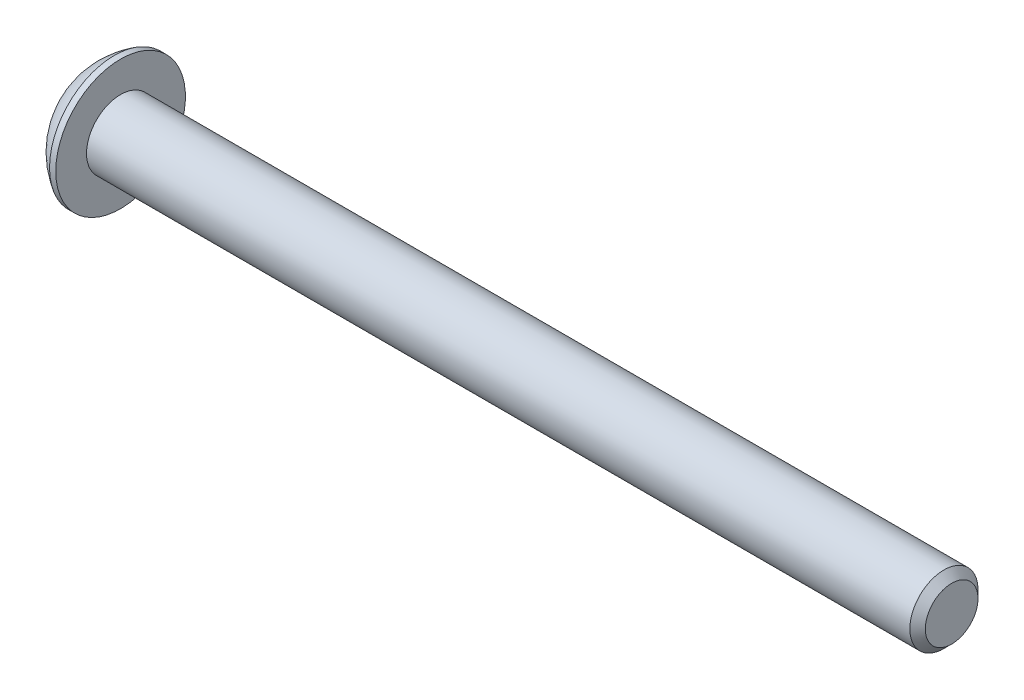
ISO-10303-21;
HEADER;
FILE_DESCRIPTION(('STEP AP214'),'2;1');
FILE_NAME('part.step','',(''),(''),'','','');
FILE_SCHEMA(('AUTOMOTIVE_DESIGN { 1 0 10303 214 1 1 1 1 }'));
ENDSEC;
DATA;
#1=APPLICATION_CONTEXT('core data for automotive mechanical design processes');
#2=APPLICATION_PROTOCOL_DEFINITION('international standard','automotive_design',2000,#1);
#3=PRODUCT_CONTEXT('',#1,'mechanical');
#4=PRODUCT('Part','Part','',(#3));
#5=PRODUCT_RELATED_PRODUCT_CATEGORY('part','',(#4));
#6=PRODUCT_DEFINITION_FORMATION('','',#4);
#7=PRODUCT_DEFINITION_CONTEXT('part definition',#1,'design');
#8=PRODUCT_DEFINITION('design','',#6,#7);
#9=PRODUCT_DEFINITION_SHAPE('','',#8);
#10=(LENGTH_UNIT() NAMED_UNIT(*) SI_UNIT(.MILLI.,.METRE.));
#11=(NAMED_UNIT(*) PLANE_ANGLE_UNIT() SI_UNIT($,.RADIAN.));
#12=(NAMED_UNIT(*) SI_UNIT($,.STERADIAN.) SOLID_ANGLE_UNIT());
#13=UNCERTAINTY_MEASURE_WITH_UNIT(LENGTH_MEASURE(1.E-05),#10,'distance_accuracy_value','');
#14=(GEOMETRIC_REPRESENTATION_CONTEXT(3) GLOBAL_UNCERTAINTY_ASSIGNED_CONTEXT((#13)) GLOBAL_UNIT_ASSIGNED_CONTEXT((#10,
#11,#12)) REPRESENTATION_CONTEXT('',''));
#15=CARTESIAN_POINT('',(0.,0.,0.));
#16=DIRECTION('',(0.,0.,1.));
#17=DIRECTION('',(1.,0.,0.));
#18=AXIS2_PLACEMENT_3D('',#15,#16,#17);
#19=CARTESIAN_POINT('',(1.32080000000034,0.,0.));
#20=DIRECTION('',(-1.,0.,0.));
#21=DIRECTION('',(0.,0.,1.));
#22=AXIS2_PLACEMENT_3D('',#19,#20,#21);
#23=CONICAL_SURFACE('',#22,1.1937999999998,1.04719755119608);
#24=CARTESIAN_POINT('',(2.01004075135902,0.,4.44089209850063E-13));
#25=VERTEX_POINT('',#24);
#26=VERTEX_LOOP('',#25);
#27=FACE_BOUND('',#26,.T.);
#28=CARTESIAN_POINT('',(1.32080000000009,0.,0.));
#29=DIRECTION('',(-1.,0.,0.));
#30=DIRECTION('',(0.,0.,1.));
#31=AXIS2_PLACEMENT_3D('',#28,#29,#30);
#32=CIRCLE('',#31,1.19380000000024);
#33=CARTESIAN_POINT('',(1.32080000000004,-1.03386112703797,0.59690000000006));
#34=VERTEX_POINT('',#33);
#35=CARTESIAN_POINT('',(1.32080000000004,0.,1.19380000000012));
#36=VERTEX_POINT('',#35);
#37=EDGE_CURVE('E19',#34,#36,#32,.T.);
#38=ORIENTED_EDGE('',*,*,#37,.T.);
#39=CARTESIAN_POINT('',(1.32080000000009,0.,0.));
#40=DIRECTION('',(-1.,0.,0.));
#41=DIRECTION('',(0.,0.,1.));
#42=AXIS2_PLACEMENT_3D('',#39,#40,#41);
#43=CIRCLE('',#42,1.19380000000024);
#44=CARTESIAN_POINT('',(1.32080000000004,1.03386112703797,0.596900000000061));
#45=VERTEX_POINT('',#44);
#46=EDGE_CURVE('E147',#36,#45,#43,.T.);
#47=ORIENTED_EDGE('',*,*,#46,.T.);
#48=CARTESIAN_POINT('',(1.32080000000009,0.,0.));
#49=DIRECTION('',(-1.,0.,0.));
#50=DIRECTION('',(0.,0.,1.));
#51=AXIS2_PLACEMENT_3D('',#48,#49,#50);
#52=CIRCLE('',#51,1.19380000000024);
#53=CARTESIAN_POINT('',(1.32080000000004,1.03386112703797,-0.596900000000061));
#54=VERTEX_POINT('',#53);
#55=EDGE_CURVE('E317',#45,#54,#52,.T.);
#56=ORIENTED_EDGE('',*,*,#55,.T.);
#57=CARTESIAN_POINT('',(1.32080000000009,0.,0.));
#58=DIRECTION('',(-1.,0.,0.));
#59=DIRECTION('',(0.,0.,1.));
#60=AXIS2_PLACEMENT_3D('',#57,#58,#59);
#61=CIRCLE('',#60,1.19380000000024);
#62=CARTESIAN_POINT('',(1.32080000000004,1.49457637585666E-12,-1.19380000000012));
#63=VERTEX_POINT('',#62);
#64=EDGE_CURVE('E318',#54,#63,#61,.T.);
#65=ORIENTED_EDGE('',*,*,#64,.T.);
#66=CARTESIAN_POINT('',(1.32080000000009,0.,0.));
#67=DIRECTION('',(-1.,0.,0.));
#68=DIRECTION('',(0.,0.,1.));
#69=AXIS2_PLACEMENT_3D('',#66,#67,#68);
#70=CIRCLE('',#69,1.19380000000024);
#71=CARTESIAN_POINT('',(1.32080000000004,-1.03386112703797,-0.59690000000006));
#72=VERTEX_POINT('',#71);
#73=EDGE_CURVE('E92',#63,#72,#70,.T.);
#74=ORIENTED_EDGE('',*,*,#73,.T.);
#75=CARTESIAN_POINT('',(1.32080000000009,0.,0.));
#76=DIRECTION('',(-1.,0.,0.));
#77=DIRECTION('',(0.,0.,1.));
#78=AXIS2_PLACEMENT_3D('',#75,#76,#77);
#79=CIRCLE('',#78,1.19380000000024);
#80=EDGE_CURVE('E88',#72,#34,#79,.T.);
#81=ORIENTED_EDGE('',*,*,#80,.T.);
#82=EDGE_LOOP('',(#38,#47,#56,#65,#74,#81));
#83=FACE_BOUND('',#82,.T.);
#84=ADVANCED_FACE('F16',(#27,#83),#23,.F.);
#85=CARTESIAN_POINT('',(1.3208,-2.06772225407572,-1.1938));
#86=DIRECTION('',(1.,0.,0.));
#87=DIRECTION('',(0.,0.,-1.));
#88=AXIS2_PLACEMENT_3D('',#85,#86,#87);
#89=PLANE('',#88);
#90=DIRECTION('',(0.,0.5,0.866025403784439));
#91=VECTOR('',#90,1.);
#92=CARTESIAN_POINT('',(1.3208,-1.37848150271715,0.));
#93=LINE('',#92,#91);
#94=CARTESIAN_POINT('',(1.3208,-0.689240751358574,1.1938));
#95=VERTEX_POINT('',#94);
#96=EDGE_CURVE('E100',#95,#34,#93,.F.);
#97=ORIENTED_EDGE('',*,*,#96,.F.);
#98=DIRECTION('',(0.,1.,0.));
#99=VECTOR('',#98,1.);
#100=CARTESIAN_POINT('',(1.3208,-0.689240751358574,1.1938));
#101=LINE('',#100,#99);
#102=EDGE_CURVE('E102',#36,#95,#101,.F.);
#103=ORIENTED_EDGE('',*,*,#102,.F.);
#104=ORIENTED_EDGE('',*,*,#37,.F.);
#105=EDGE_LOOP('',(#97,#103,#104));
#106=FACE_BOUND('',#105,.T.);
#107=ADVANCED_FACE('F98',(#106),#89,.F.);
#108=CARTESIAN_POINT('',(1.3208,-2.06772225407572,-1.1938));
#109=DIRECTION('',(1.,0.,0.));
#110=DIRECTION('',(0.,0.,-1.));
#111=AXIS2_PLACEMENT_3D('',#108,#109,#110);
#112=PLANE('',#111);
#113=DIRECTION('',(0.,-0.5,0.866025403784439));
#114=VECTOR('',#113,1.);
#115=CARTESIAN_POINT('',(1.3208,-0.689240751358574,-1.1938));
#116=LINE('',#115,#114);
#117=CARTESIAN_POINT('',(1.3208,-1.37848150271715,0.));
#118=VERTEX_POINT('',#117);
#119=EDGE_CURVE('E108',#118,#72,#116,.F.);
#120=ORIENTED_EDGE('',*,*,#119,.F.);
#121=DIRECTION('',(0.,0.5,0.866025403784439));
#122=VECTOR('',#121,1.);
#123=CARTESIAN_POINT('',(1.3208,-1.37848150271715,0.));
#124=LINE('',#123,#122);
#125=EDGE_CURVE('E105',#34,#118,#124,.F.);
#126=ORIENTED_EDGE('',*,*,#125,.F.);
#127=ORIENTED_EDGE('',*,*,#80,.F.);
#128=EDGE_LOOP('',(#120,#126,#127));
#129=FACE_BOUND('',#128,.T.);
#130=ADVANCED_FACE('F106',(#129),#112,.F.);
#131=CARTESIAN_POINT('',(1.3208,-2.06772225407572,-1.1938));
#132=DIRECTION('',(1.,0.,0.));
#133=DIRECTION('',(0.,0.,-1.));
#134=AXIS2_PLACEMENT_3D('',#131,#132,#133);
#135=PLANE('',#134);
#136=DIRECTION('',(0.,1.,0.));
#137=VECTOR('',#136,1.);
#138=CARTESIAN_POINT('',(1.3208,0.689240751358577,-1.1938));
#139=LINE('',#138,#137);
#140=CARTESIAN_POINT('',(1.3208,-0.689240751358574,-1.1938));
#141=VERTEX_POINT('',#140);
#142=EDGE_CURVE('E287',#141,#63,#139,.T.);
#143=ORIENTED_EDGE('',*,*,#142,.F.);
#144=DIRECTION('',(0.,-0.5,0.866025403784439));
#145=VECTOR('',#144,1.);
#146=CARTESIAN_POINT('',(1.3208,-0.689240751358574,-1.1938));
#147=LINE('',#146,#145);
#148=EDGE_CURVE('E299',#72,#141,#147,.F.);
#149=ORIENTED_EDGE('',*,*,#148,.F.);
#150=ORIENTED_EDGE('',*,*,#73,.F.);
#151=EDGE_LOOP('',(#143,#149,#150));
#152=FACE_BOUND('',#151,.T.);
#153=ADVANCED_FACE('F190',(#152),#135,.F.);
#154=CARTESIAN_POINT('',(1.3208,-2.06772225407572,-1.1938));
#155=DIRECTION('',(1.,0.,0.));
#156=DIRECTION('',(0.,0.,-1.));
#157=AXIS2_PLACEMENT_3D('',#154,#155,#156);
#158=PLANE('',#157);
#159=DIRECTION('',(0.,-0.5,-0.866025403784439));
#160=VECTOR('',#159,1.);
#161=CARTESIAN_POINT('',(1.3208,1.37848150271715,0.));
#162=LINE('',#161,#160);
#163=CARTESIAN_POINT('',(1.3208,0.689240751358577,-1.1938));
#164=VERTEX_POINT('',#163);
#165=EDGE_CURVE('E273',#164,#54,#162,.F.);
#166=ORIENTED_EDGE('',*,*,#165,.F.);
#167=DIRECTION('',(0.,1.,0.));
#168=VECTOR('',#167,1.);
#169=CARTESIAN_POINT('',(1.3208,0.689240751358577,-1.1938));
#170=LINE('',#169,#168);
#171=EDGE_CURVE('E284',#63,#164,#170,.T.);
#172=ORIENTED_EDGE('',*,*,#171,.F.);
#173=ORIENTED_EDGE('',*,*,#64,.F.);
#174=EDGE_LOOP('',(#166,#172,#173));
#175=FACE_BOUND('',#174,.T.);
#176=ADVANCED_FACE('F186',(#175),#158,.F.);
#177=CARTESIAN_POINT('',(1.3208,-2.06772225407572,-1.1938));
#178=DIRECTION('',(1.,0.,0.));
#179=DIRECTION('',(0.,0.,-1.));
#180=AXIS2_PLACEMENT_3D('',#177,#178,#179);
#181=PLANE('',#180);
#182=DIRECTION('',(0.,0.5,-0.866025403784439));
#183=VECTOR('',#182,1.);
#184=CARTESIAN_POINT('',(1.3208,0.689240751358576,1.1938));
#185=LINE('',#184,#183);
#186=CARTESIAN_POINT('',(1.3208,1.37848150271715,0.));
#187=VERTEX_POINT('',#186);
#188=EDGE_CURVE('E252',#187,#45,#185,.F.);
#189=ORIENTED_EDGE('',*,*,#188,.F.);
#190=DIRECTION('',(0.,-0.5,-0.866025403784439));
#191=VECTOR('',#190,1.);
#192=CARTESIAN_POINT('',(1.3208,1.37848150271715,0.));
#193=LINE('',#192,#191);
#194=EDGE_CURVE('E271',#54,#187,#193,.F.);
#195=ORIENTED_EDGE('',*,*,#194,.F.);
#196=ORIENTED_EDGE('',*,*,#55,.F.);
#197=EDGE_LOOP('',(#189,#195,#196));
#198=FACE_BOUND('',#197,.T.);
#199=ADVANCED_FACE('F182',(#198),#181,.F.);
#200=CARTESIAN_POINT('',(1.3208,-2.06772225407572,-1.1938));
#201=DIRECTION('',(1.,0.,0.));
#202=DIRECTION('',(0.,0.,-1.));
#203=AXIS2_PLACEMENT_3D('',#200,#201,#202);
#204=PLANE('',#203);
#205=DIRECTION('',(0.,1.,0.));
#206=VECTOR('',#205,1.);
#207=CARTESIAN_POINT('',(1.3208,-0.689240751358574,1.1938));
#208=LINE('',#207,#206);
#209=CARTESIAN_POINT('',(1.3208,0.689240751358576,1.1938));
#210=VERTEX_POINT('',#209);
#211=EDGE_CURVE('E117',#210,#36,#208,.F.);
#212=ORIENTED_EDGE('',*,*,#211,.F.);
#213=DIRECTION('',(0.,0.5,-0.866025403784439));
#214=VECTOR('',#213,1.);
#215=CARTESIAN_POINT('',(1.3208,0.689240751358576,1.1938));
#216=LINE('',#215,#214);
#217=EDGE_CURVE('E255',#45,#210,#216,.F.);
#218=ORIENTED_EDGE('',*,*,#217,.F.);
#219=ORIENTED_EDGE('',*,*,#46,.F.);
#220=EDGE_LOOP('',(#212,#218,#219));
#221=FACE_BOUND('',#220,.T.);
#222=ADVANCED_FACE('F178',(#221),#204,.F.);
#223=CARTESIAN_POINT('',(1.3208,-0.689240751358574,1.1938));
#224=DIRECTION('',(0.,0.,-1.));
#225=DIRECTION('',(0.,1.,0.));
#226=AXIS2_PLACEMENT_3D('',#223,#224,#225);
#227=PLANE('',#226);
#228=DIRECTION('',(0.,1.,0.));
#229=VECTOR('',#228,1.);
#230=CARTESIAN_POINT('',(0.,0.,1.1938));
#231=LINE('',#230,#229);
#232=CARTESIAN_POINT('',(0.,0.689240751358577,1.1938));
#233=VERTEX_POINT('',#232);
#234=CARTESIAN_POINT('',(0.,-0.689240751358574,1.1938));
#235=VERTEX_POINT('',#234);
#236=EDGE_CURVE('E249',#233,#235,#231,.F.);
#237=ORIENTED_EDGE('',*,*,#236,.F.);
#238=DIRECTION('',(1.,0.,0.));
#239=VECTOR('',#238,1.);
#240=CARTESIAN_POINT('',(1.3208,0.689240751358576,1.1938));
#241=LINE('',#240,#239);
#242=EDGE_CURVE('E261',#210,#233,#241,.F.);
#243=ORIENTED_EDGE('',*,*,#242,.F.);
#244=ORIENTED_EDGE('',*,*,#211,.T.);
#245=ORIENTED_EDGE('',*,*,#102,.T.);
#246=DIRECTION('',(1.,0.,0.));
#247=VECTOR('',#246,1.);
#248=CARTESIAN_POINT('',(1.3208,-0.689240751358574,1.1938));
#249=LINE('',#248,#247);
#250=EDGE_CURVE('E111',#235,#95,#249,.T.);
#251=ORIENTED_EDGE('',*,*,#250,.F.);
#252=EDGE_LOOP('',(#237,#243,#244,#245,#251));
#253=FACE_BOUND('',#252,.T.);
#254=ADVANCED_FACE('F175',(#253),#227,.T.);
#255=CARTESIAN_POINT('',(1.3208,-1.37848150271715,0.));
#256=DIRECTION('',(0.,0.866025403784439,-0.5));
#257=DIRECTION('',(0.,0.5,0.866025403784439));
#258=AXIS2_PLACEMENT_3D('',#255,#256,#257);
#259=PLANE('',#258);
#260=DIRECTION('',(0.,-0.5,-0.866025403784439));
#261=VECTOR('',#260,1.);
#262=CARTESIAN_POINT('',(0.,-0.689240751358574,1.1938));
#263=LINE('',#262,#261);
#264=CARTESIAN_POINT('',(0.,-1.37848150271715,0.));
#265=VERTEX_POINT('',#264);
#266=EDGE_CURVE('E246',#235,#265,#263,.T.);
#267=ORIENTED_EDGE('',*,*,#266,.F.);
#268=ORIENTED_EDGE('',*,*,#250,.T.);
#269=ORIENTED_EDGE('',*,*,#96,.T.);
#270=ORIENTED_EDGE('',*,*,#125,.T.);
#271=DIRECTION('',(1.,0.,0.));
#272=VECTOR('',#271,1.);
#273=CARTESIAN_POINT('',(1.3208,-1.37848150271715,0.));
#274=LINE('',#273,#272);
#275=EDGE_CURVE('E296',#265,#118,#274,.T.);
#276=ORIENTED_EDGE('',*,*,#275,.F.);
#277=EDGE_LOOP('',(#267,#268,#269,#270,#276));
#278=FACE_BOUND('',#277,.T.);
#279=ADVANCED_FACE('F115',(#278),#259,.T.);
#280=CARTESIAN_POINT('',(1.3208,-0.689240751358574,-1.1938));
#281=DIRECTION('',(0.,0.866025403784439,0.5));
#282=DIRECTION('',(0.,-0.5,0.866025403784439));
#283=AXIS2_PLACEMENT_3D('',#280,#281,#282);
#284=PLANE('',#283);
#285=DIRECTION('',(0.,0.5,-0.866025403784439));
#286=VECTOR('',#285,1.);
#287=CARTESIAN_POINT('',(0.,-1.37848150271715,0.));
#288=LINE('',#287,#286);
#289=CARTESIAN_POINT('',(0.,-0.689240751358574,-1.1938));
#290=VERTEX_POINT('',#289);
#291=EDGE_CURVE('E243',#265,#290,#288,.T.);
#292=ORIENTED_EDGE('',*,*,#291,.F.);
#293=ORIENTED_EDGE('',*,*,#275,.T.);
#294=ORIENTED_EDGE('',*,*,#119,.T.);
#295=ORIENTED_EDGE('',*,*,#148,.T.);
#296=DIRECTION('',(1.,0.,0.));
#297=VECTOR('',#296,1.);
#298=CARTESIAN_POINT('',(1.3208,-0.689240751358574,-1.1938));
#299=LINE('',#298,#297);
#300=EDGE_CURVE('E281',#290,#141,#299,.T.);
#301=ORIENTED_EDGE('',*,*,#300,.F.);
#302=EDGE_LOOP('',(#292,#293,#294,#295,#301));
#303=FACE_BOUND('',#302,.T.);
#304=ADVANCED_FACE('F168',(#303),#284,.T.);
#305=CARTESIAN_POINT('',(1.3208,0.689240751358577,-1.1938));
#306=DIRECTION('',(0.,0.,1.));
#307=DIRECTION('',(1.,0.,0.));
#308=AXIS2_PLACEMENT_3D('',#305,#306,#307);
#309=PLANE('',#308);
#310=DIRECTION('',(0.,1.,0.));
#311=VECTOR('',#310,1.);
#312=CARTESIAN_POINT('',(0.,0.,-1.1938));
#313=LINE('',#312,#311);
#314=CARTESIAN_POINT('',(0.,0.689240751358577,-1.1938));
#315=VERTEX_POINT('',#314);
#316=EDGE_CURVE('E240',#290,#315,#313,.T.);
#317=ORIENTED_EDGE('',*,*,#316,.F.);
#318=ORIENTED_EDGE('',*,*,#300,.T.);
#319=ORIENTED_EDGE('',*,*,#142,.T.);
#320=ORIENTED_EDGE('',*,*,#171,.T.);
#321=DIRECTION('',(1.,0.,0.));
#322=VECTOR('',#321,1.);
#323=CARTESIAN_POINT('',(1.3208,0.689240751358577,-1.1938));
#324=LINE('',#323,#322);
#325=EDGE_CURVE('E256',#315,#164,#324,.T.);
#326=ORIENTED_EDGE('',*,*,#325,.F.);
#327=EDGE_LOOP('',(#317,#318,#319,#320,#326));
#328=FACE_BOUND('',#327,.T.);
#329=ADVANCED_FACE('F165',(#328),#309,.T.);
#330=CARTESIAN_POINT('',(1.3208,1.37848150271715,0.));
#331=DIRECTION('',(0.,-0.866025403784439,0.5));
#332=DIRECTION('',(0.,-0.5,-0.866025403784439));
#333=AXIS2_PLACEMENT_3D('',#330,#331,#332);
#334=PLANE('',#333);
#335=DIRECTION('',(0.,0.5,0.866025403784439));
#336=VECTOR('',#335,1.);
#337=CARTESIAN_POINT('',(0.,0.689240751358577,-1.1938));
#338=LINE('',#337,#336);
#339=CARTESIAN_POINT('',(0.,1.37848150271715,0.));
#340=VERTEX_POINT('',#339);
#341=EDGE_CURVE('E237',#315,#340,#338,.T.);
#342=ORIENTED_EDGE('',*,*,#341,.F.);
#343=ORIENTED_EDGE('',*,*,#325,.T.);
#344=ORIENTED_EDGE('',*,*,#165,.T.);
#345=ORIENTED_EDGE('',*,*,#194,.T.);
#346=DIRECTION('',(1.,0.,0.));
#347=VECTOR('',#346,1.);
#348=CARTESIAN_POINT('',(1.3208,1.37848150271715,0.));
#349=LINE('',#348,#347);
#350=EDGE_CURVE('E34',#340,#187,#349,.T.);
#351=ORIENTED_EDGE('',*,*,#350,.F.);
#352=EDGE_LOOP('',(#342,#343,#344,#345,#351));
#353=FACE_BOUND('',#352,.T.);
#354=ADVANCED_FACE('F161',(#353),#334,.T.);
#355=CARTESIAN_POINT('',(1.3208,0.689240751358576,1.1938));
#356=DIRECTION('',(0.,-0.866025403784439,-0.5));
#357=DIRECTION('',(0.,0.5,-0.866025403784439));
#358=AXIS2_PLACEMENT_3D('',#355,#356,#357);
#359=PLANE('',#358);
#360=DIRECTION('',(0.,-0.5,0.866025403784439));
#361=VECTOR('',#360,1.);
#362=CARTESIAN_POINT('',(0.,1.37848150271715,0.));
#363=LINE('',#362,#361);
#364=EDGE_CURVE('E146',#340,#233,#363,.T.);
#365=ORIENTED_EDGE('',*,*,#364,.F.);
#366=ORIENTED_EDGE('',*,*,#350,.T.);
#367=ORIENTED_EDGE('',*,*,#188,.T.);
#368=ORIENTED_EDGE('',*,*,#217,.T.);
#369=ORIENTED_EDGE('',*,*,#242,.T.);
#370=EDGE_LOOP('',(#365,#366,#367,#368,#369));
#371=FACE_BOUND('',#370,.T.);
#372=ADVANCED_FACE('F157',(#371),#359,.T.);
#373=CARTESIAN_POINT('',(0.,0.,0.));
#374=DIRECTION('',(-1.,0.,0.));
#375=DIRECTION('',(0.,0.,1.));
#376=AXIS2_PLACEMENT_3D('',#373,#374,#375);
#377=PLANE('',#376);
#378=ORIENTED_EDGE('',*,*,#341,.T.);
#379=ORIENTED_EDGE('',*,*,#364,.T.);
#380=ORIENTED_EDGE('',*,*,#236,.T.);
#381=ORIENTED_EDGE('',*,*,#266,.T.);
#382=ORIENTED_EDGE('',*,*,#291,.T.);
#383=ORIENTED_EDGE('',*,*,#316,.T.);
#384=EDGE_LOOP('',(#378,#379,#380,#381,#382,#383));
#385=FACE_BOUND('',#384,.T.);
#386=CARTESIAN_POINT('',(0.,1.9812,0.));
#387=CARTESIAN_POINT('',(0.,1.9811996664299,0.0556258831179428));
#388=CARTESIAN_POINT('',(0.,1.97885520380442,0.111261989398606));
#389=CARTESIAN_POINT('',(0.,1.96949260169541,0.222149719830458));
#390=CARTESIAN_POINT('',(0.,1.96247308239605,0.277401225602895));
#391=CARTESIAN_POINT('',(0.,1.94379192841038,0.387209508139747));
#392=CARTESIAN_POINT('',(-1.85325793235264E-13,1.93212292489526,0.441765039546365));
#393=CARTESIAN_POINT('',(1.86344214223505E-13,1.90422331175315,0.549729449347493));
#394=CARTESIAN_POINT('',(6.94543371897454E-13,1.88798900035338,0.603137359208869));
#395=CARTESIAN_POINT('',(1.15501975216981E-12,1.83266214476501,0.760839131321828));
#396=CARTESIAN_POINT('',(0.,1.78690023648845,0.862876433575429));
#397=CARTESIAN_POINT('',(0.,1.67887358150667,1.05780719540872));
#398=CARTESIAN_POINT('',(9.54193214892627E-13,1.6166082074585,1.15070030720801));
#399=CARTESIAN_POINT('',(5.94805591894675E-13,1.51224157140982,1.28116890915697));
#400=CARTESIAN_POINT('',(1.63221293851378E-13,1.4755970394354,1.32320451127026));
#401=CARTESIAN_POINT('',(-1.62196980336157E-13,1.39893832619713,1.40400288695709));
#402=CARTESIAN_POINT('',(0.,1.35892742784698,1.44276877695455));
#403=CARTESIAN_POINT('',(1.14362537325405E-13,1.23416504602197,1.55382272417904));
#404=CARTESIAN_POINT('',(0.,1.14466125559859,1.62089527952111));
#405=CARTESIAN_POINT('',(0.,0.955712144178167,1.7390221808118));
#406=CARTESIAN_POINT('',(0.,0.856267198233564,1.79007713076007));
#407=CARTESIAN_POINT('',(0.,0.650206345910843,1.87477637530954));
#408=CARTESIAN_POINT('',(0.,0.543590516134855,1.90842085586267));
#409=CARTESIAN_POINT('',(0.,0.326226155292018,1.95733039300656));
#410=CARTESIAN_POINT('',(0.,0.21547760215793,1.97259535144288));
#411=CARTESIAN_POINT('',(0.,-0.00701040587544639,1.98431697865418));
#412=CARTESIAN_POINT('',(0.,-0.118749860774734,1.98077364742917));
#413=CARTESIAN_POINT('',(0.,-0.340050178355485,1.95497485623825));
#414=CARTESIAN_POINT('',(0.,-0.449611052668255,1.93271949620218));
#415=CARTESIAN_POINT('',(0.,-0.663431110729174,1.87014138774523));
#416=CARTESIAN_POINT('',(0.,-0.76769023783852,1.82981844635272));
#417=CARTESIAN_POINT('',(0.,-0.968005760719347,1.73219968377096));
#418=CARTESIAN_POINT('',(0.,-1.0640618469811,1.6749032225164));
#419=CARTESIAN_POINT('',(0.,-1.19980276751283,1.57757371205873));
#420=CARTESIAN_POINT('',(0.,-1.24366557129213,1.54322665019466));
#421=CARTESIAN_POINT('',(0.,-1.32838995706696,1.47093063174264));
#422=CARTESIAN_POINT('',(0.,-1.36924860178706,1.43297823102439));
#423=CARTESIAN_POINT('',(0.,-1.48674671849223,1.31419842051173));
#424=CARTESIAN_POINT('',(0.,-1.55842832343237,1.22836221289311));
#425=CARTESIAN_POINT('',(0.,-1.6863396856475,1.04586168272493));
#426=CARTESIAN_POINT('',(0.,-1.7425700302488,0.949197771949774));
#427=CARTESIAN_POINT('',(0.,-1.8141614250401,0.798182600298684));
#428=CARTESIAN_POINT('',(0.,-1.83591780585875,0.746776203847791));
#429=CARTESIAN_POINT('',(0.,-1.87500754181092,0.642341081688636));
#430=CARTESIAN_POINT('',(0.,-1.89234447645404,0.589313708122847));
#431=CARTESIAN_POINT('',(0.,-1.92246053433554,0.482076273028395));
#432=CARTESIAN_POINT('',(0.,-1.93524685475118,0.42786822425751));
#433=CARTESIAN_POINT('',(0.,-1.95620937250494,0.318578151844611));
#434=CARTESIAN_POINT('',(0.,-1.96438692958147,0.263496390912872));
#435=CARTESIAN_POINT('',(0.,-1.97388528284653,0.173607715038558));
#436=CARTESIAN_POINT('',(0.,-1.97662743364426,0.138944718024998));
#437=CARTESIAN_POINT('',(0.,-1.98028489645283,0.0695224782567002));
#438=CARTESIAN_POINT('',(0.,-1.98120020846367,0.0347632355019631));
#439=CARTESIAN_POINT('',(0.,-1.9811996664299,-0.0556258831179437));
#440=CARTESIAN_POINT('',(0.,-1.97885520380442,-0.111261989398607));
#441=CARTESIAN_POINT('',(0.,-1.96949260169541,-0.222149719830459));
#442=CARTESIAN_POINT('',(0.,-1.96247308239605,-0.277401225602897));
#443=CARTESIAN_POINT('',(0.,-1.94379192841039,-0.387209508139749));
#444=CARTESIAN_POINT('',(-1.85269749640691E-13,-1.93212292489526,-0.441765039546367));
#445=CARTESIAN_POINT('',(1.86288125054388E-13,-1.90422331175315,-0.549729449347495));
#446=CARTESIAN_POINT('',(6.94525090263764E-13,-1.88798900035338,-0.603137359208872));
#447=CARTESIAN_POINT('',(1.15505622829081E-12,-1.83266214476501,-0.760839131321831));
#448=CARTESIAN_POINT('',(0.,-1.78690023648845,-0.862876433575431));
#449=CARTESIAN_POINT('',(0.,-1.67887358150667,-1.05780719540872));
#450=CARTESIAN_POINT('',(9.54248812869379E-13,-1.6166082074585,-1.15070030720801));
#451=CARTESIAN_POINT('',(5.94777756479239E-13,-1.51224157140982,-1.28116890915698));
#452=CARTESIAN_POINT('',(1.63138949183833E-13,-1.47559703943539,-1.32320451127027));
#453=CARTESIAN_POINT('',(-1.62114715061273E-13,-1.39893832619713,-1.40400288695709));
#454=CARTESIAN_POINT('',(0.,-1.35892742784699,-1.44276877695455));
#455=CARTESIAN_POINT('',(1.13760489124207E-13,-1.23416504602197,-1.55382272417904));
#456=CARTESIAN_POINT('',(0.,-1.14466125559859,-1.62089527952111));
#457=CARTESIAN_POINT('',(0.,-0.95571214417816,-1.73902218081179));
#458=CARTESIAN_POINT('',(0.,-0.856267198233559,-1.79007713076007));
#459=CARTESIAN_POINT('',(0.,-0.650206345910841,-1.87477637530954));
#460=CARTESIAN_POINT('',(0.,-0.543590516134854,-1.90842085586267));
#461=CARTESIAN_POINT('',(0.,-0.326226155292018,-1.95733039300657));
#462=CARTESIAN_POINT('',(0.,-0.215477602157929,-1.97259535144288));
#463=CARTESIAN_POINT('',(0.,0.0070104058754487,-1.98431697865418));
#464=CARTESIAN_POINT('',(0.,0.118749860774737,-1.98077364742916));
#465=CARTESIAN_POINT('',(0.,0.340050178355489,-1.95497485623824));
#466=CARTESIAN_POINT('',(0.,0.44961105266826,-1.93271949620218));
#467=CARTESIAN_POINT('',(0.,0.663431110729178,-1.87014138774524));
#468=CARTESIAN_POINT('',(0.,0.767690237838524,-1.82981844635272));
#469=CARTESIAN_POINT('',(0.,0.968005760719348,-1.73219968377096));
#470=CARTESIAN_POINT('',(0.,1.0640618469811,-1.67490322251639));
#471=CARTESIAN_POINT('',(0.,1.19980276751283,-1.57757371205873));
#472=CARTESIAN_POINT('',(0.,1.24366557129214,-1.54322665019465));
#473=CARTESIAN_POINT('',(0.,1.32838995706696,-1.47093063174263));
#474=CARTESIAN_POINT('',(0.,1.36924860178706,-1.43297823102439));
#475=CARTESIAN_POINT('',(0.,1.48674671849223,-1.31419842051172));
#476=CARTESIAN_POINT('',(0.,1.55842832343237,-1.22836221289311));
#477=CARTESIAN_POINT('',(0.,1.6863396856475,-1.04586168272492));
#478=CARTESIAN_POINT('',(0.,1.7425700302488,-0.949197771949768));
#479=CARTESIAN_POINT('',(0.,1.8141614250401,-0.798182600298677));
#480=CARTESIAN_POINT('',(0.,1.83591780585875,-0.746776203847785));
#481=CARTESIAN_POINT('',(0.,1.87500754181092,-0.64234108168863));
#482=CARTESIAN_POINT('',(0.,1.89234447645404,-0.589313708122841));
#483=CARTESIAN_POINT('',(0.,1.92246053433555,-0.482076273028389));
#484=CARTESIAN_POINT('',(0.,1.93524685475118,-0.427868224257505));
#485=CARTESIAN_POINT('',(0.,1.95620937250494,-0.318578151844605));
#486=CARTESIAN_POINT('',(0.,1.96438692958147,-0.263496390912866));
#487=CARTESIAN_POINT('',(0.,1.97388528284653,-0.173607715038553));
#488=CARTESIAN_POINT('',(0.,1.97662743364426,-0.138944718024994));
#489=CARTESIAN_POINT('',(0.,1.98028489645283,-0.0695224782566989));
#490=CARTESIAN_POINT('',(0.,1.98120020846367,-0.034763235501963));
#491=CARTESIAN_POINT('',(0.,1.9812,0.));
#492=B_SPLINE_CURVE_WITH_KNOTS('',3,(#386,#387,#388,#389,#390,#391,#392,#393,#394,#395,#396,
#397,#398,#399,#400,#401,#402,#403,#404,#405,#406,#407,#408,#409,#410,#411,#412,#413,#414,#415,
#416,#417,#418,#419,#420,#421,#422,#423,#424,#425,#426,#427,#428,#429,#430,#431,#432,#433,#434,
#435,#436,#437,#438,#439,#440,#441,#442,#443,#444,#445,#446,#447,#448,#449,#450,#451,#452,#453,
#454,#455,#456,#457,#458,#459,#460,#461,#462,#463,#464,#465,#466,#467,#468,#469,#470,#471,#472,
#473,#474,#475,#476,#477,#478,#479,#480,#481,#482,#483,#484,#485,#486,#487,#488,#489,#490,#491),
.UNSPECIFIED.,.T.,.F.,(4,2,2,2,2,2,2,2,2,2,2,2,2,2,2,2,2,2,2,2,2,2,2,2,2,2,2,2,2,2,2,2,2,2,2,2,
2,2,2,2,2,2,2,2,2,2,2,2,2,2,2,2,4),(0.,0.166845646007828,0.333740557374255,0.500901034367693,
0.668197445942386,1.00199278686282,1.33580081809885,1.50292354032982,1.6698851310853,
2.00370118900129,2.33750465770544,2.67130456115909,3.005106247238,3.33890793331696,
3.67270783677065,4.00651130547476,4.34032736339026,4.50728895414554,4.67441167637632,
5.00821970761259,5.34201504853332,5.50931146010827,5.67647193710191,5.84336684846844,
6.0102124944764,6.11448220058334,6.21875190669029,6.38559755269812,6.55249246406454,
6.71965294105798,6.88694935263268,7.22074469355311,7.55455272478915,7.72167544702011,
7.88863703777559,8.22245309569158,8.55625656439573,8.89005646784938,9.2238581539283,
9.55765984000725,9.89145974346094,10.2252632121651,10.5590792700806,10.7260408608358,
10.8931635830666,11.2269716143029,11.5607669552236,11.7280633667986,11.8952238437922,
12.0621187551587,12.2289644011667,12.3332341072736,12.4375038133806),.UNSPECIFIED.);
#493=CARTESIAN_POINT('',(0.,1.9812,0.));
#494=VERTEX_POINT('',#493);
#495=EDGE_CURVE('E139',#494,#494,#492,.T.);
#496=ORIENTED_EDGE('',*,*,#495,.F.);
#497=EDGE_LOOP('',(#496));
#498=FACE_BOUND('',#497,.T.);
#499=ADVANCED_FACE('F153',(#385,#498),#377,.T.);
#500=CARTESIAN_POINT('',(4.13385,0.,0.));
#501=DIRECTION('',(0.,1.,0.));
#502=DIRECTION('',(1.,0.,0.));
#503=AXIS2_PLACEMENT_3D('',#500,#501,#502);
#504=SPHERICAL_SURFACE('',#503,4.58408870578439);
#505=CARTESIAN_POINT('',(1.8288,0.,0.));
#506=DIRECTION('',(-1.,0.,0.));
#507=DIRECTION('',(0.,0.,1.));
#508=AXIS2_PLACEMENT_3D('',#505,#506,#507);
#509=CIRCLE('',#508,3.9624);
#510=CARTESIAN_POINT('',(1.8288,0.,3.9624));
#511=VERTEX_POINT('',#510);
#512=EDGE_CURVE('E136',#511,#511,#509,.F.);
#513=ORIENTED_EDGE('',*,*,#512,.F.);
#514=EDGE_LOOP('',(#513));
#515=FACE_BOUND('',#514,.T.);
#516=ORIENTED_EDGE('',*,*,#495,.T.);
#517=EDGE_LOOP('',(#516));
#518=FACE_BOUND('',#517,.T.);
#519=ADVANCED_FACE('F149',(#515,#518),#504,.T.);
#520=CARTESIAN_POINT('',(53.0098,0.,0.));
#521=DIRECTION('',(-1.,0.,0.));
#522=DIRECTION('',(0.,0.,1.));
#523=AXIS2_PLACEMENT_3D('',#520,#521,#522);
#524=PLANE('',#523);
#525=CARTESIAN_POINT('',(53.0097999999839,0.,0.));
#526=DIRECTION('',(-1.,0.,0.));
#527=DIRECTION('',(0.,0.,1.));
#528=AXIS2_PLACEMENT_3D('',#525,#526,#527);
#529=CIRCLE('',#528,1.61036000002923);
#530=CARTESIAN_POINT('',(53.0097999999839,0.,1.61036000002923));
#531=VERTEX_POINT('',#530);
#532=EDGE_CURVE('E133',#531,#531,#529,.T.);
#533=ORIENTED_EDGE('',*,*,#532,.F.);
#534=EDGE_LOOP('',(#533));
#535=FACE_BOUND('',#534,.T.);
#536=ADVANCED_FACE('F221',(#535),#524,.F.);
#537=CARTESIAN_POINT('',(0.,0.,0.));
#538=DIRECTION('',(-1.,0.,0.));
#539=DIRECTION('',(0.,0.,1.));
#540=AXIS2_PLACEMENT_3D('',#537,#538,#539);
#541=CYLINDRICAL_SURFACE('',#540,3.9624);
#542=ORIENTED_EDGE('',*,*,#512,.T.);
#543=EDGE_LOOP('',(#542));
#544=FACE_BOUND('',#543,.T.);
#545=CARTESIAN_POINT('',(2.2098,0.,0.));
#546=DIRECTION('',(-1.,0.,0.));
#547=DIRECTION('',(0.,0.,1.));
#548=AXIS2_PLACEMENT_3D('',#545,#546,#547);
#549=CIRCLE('',#548,3.9624);
#550=CARTESIAN_POINT('',(2.2098,0.,3.9624));
#551=VERTEX_POINT('',#550);
#552=EDGE_CURVE('E130',#551,#551,#549,.T.);
#553=ORIENTED_EDGE('',*,*,#552,.T.);
#554=EDGE_LOOP('',(#553));
#555=FACE_BOUND('',#554,.T.);
#556=ADVANCED_FACE('F218',(#544,#555),#541,.T.);
#557=CARTESIAN_POINT('',(52.5373600000307,0.,0.));
#558=DIRECTION('',(-1.,0.,0.));
#559=DIRECTION('',(0.,0.,1.));
#560=AXIS2_PLACEMENT_3D('',#557,#558,#559);
#561=CONICAL_SURFACE('',#560,2.08279999992556,0.785398163337289);
#562=ORIENTED_EDGE('',*,*,#532,.T.);
#563=EDGE_LOOP('',(#562));
#564=FACE_BOUND('',#563,.T.);
#565=CARTESIAN_POINT('',(52.53736,0.,0.));
#566=DIRECTION('',(-1.,0.,0.));
#567=DIRECTION('',(0.,0.,1.));
#568=AXIS2_PLACEMENT_3D('',#565,#566,#567);
#569=CIRCLE('',#568,2.0828);
#570=CARTESIAN_POINT('',(52.53736,0.,2.0828));
#571=VERTEX_POINT('',#570);
#572=EDGE_CURVE('E25',#571,#571,#569,.T.);
#573=ORIENTED_EDGE('',*,*,#572,.F.);
#574=EDGE_LOOP('',(#573));
#575=FACE_BOUND('',#574,.T.);
#576=ADVANCED_FACE('F210',(#564,#575),#561,.T.);
#577=CARTESIAN_POINT('',(2.2098,2.0828,0.));
#578=DIRECTION('',(-1.,0.,0.));
#579=DIRECTION('',(0.,0.,1.));
#580=AXIS2_PLACEMENT_3D('',#577,#578,#579);
#581=PLANE('',#580);
#582=CARTESIAN_POINT('',(2.2098,0.,0.));
#583=DIRECTION('',(-1.,0.,0.));
#584=DIRECTION('',(0.,0.,1.));
#585=AXIS2_PLACEMENT_3D('',#582,#583,#584);
#586=CIRCLE('',#585,2.0828);
#587=CARTESIAN_POINT('',(2.2098,0.,2.0828));
#588=VERTEX_POINT('',#587);
#589=EDGE_CURVE('E10',#588,#588,#586,.F.);
#590=ORIENTED_EDGE('',*,*,#589,.F.);
#591=EDGE_LOOP('',(#590));
#592=FACE_BOUND('',#591,.T.);
#593=ORIENTED_EDGE('',*,*,#552,.F.);
#594=EDGE_LOOP('',(#593));
#595=FACE_BOUND('',#594,.T.);
#596=ADVANCED_FACE('F204',(#592,#595),#581,.F.);
#597=CARTESIAN_POINT('',(0.,0.,0.));
#598=DIRECTION('',(-1.,0.,0.));
#599=DIRECTION('',(0.,0.,1.));
#600=AXIS2_PLACEMENT_3D('',#597,#598,#599);
#601=CYLINDRICAL_SURFACE('',#600,2.0828);
#602=ORIENTED_EDGE('',*,*,#572,.T.);
#603=EDGE_LOOP('',(#602));
#604=FACE_BOUND('',#603,.T.);
#605=ORIENTED_EDGE('',*,*,#589,.T.);
#606=EDGE_LOOP('',(#605));
#607=FACE_BOUND('',#606,.T.);
#608=ADVANCED_FACE('F202',(#604,#607),#601,.T.);
#609=CLOSED_SHELL('',(#84,#107,#130,#153,#176,#199,#222,#254,#279,#304,#329,#354,#372,#499,#519,
#536,#556,#576,#596,#608));
#610=MANIFOLD_SOLID_BREP('B1',#609);
#611=ADVANCED_BREP_SHAPE_REPRESENTATION('',(#18,#610),#14);
#612=SHAPE_DEFINITION_REPRESENTATION(#9,#611);
ENDSEC;
END-ISO-10303-21;
